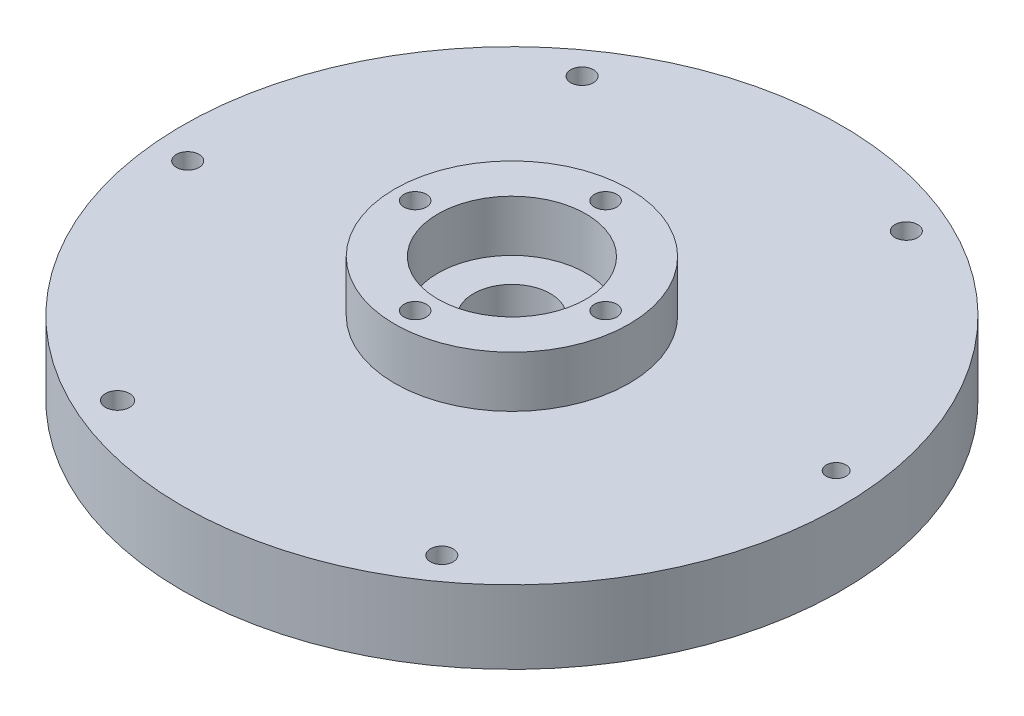
ISO-10303-21;
HEADER;
FILE_DESCRIPTION(('STEP AP214'),'2;1');
FILE_NAME('part.step','',(''),(''),'','','');
FILE_SCHEMA(('AUTOMOTIVE_DESIGN { 1 0 10303 214 1 1 1 1 }'));
ENDSEC;
DATA;
#1=APPLICATION_CONTEXT('core data for automotive mechanical design processes');
#2=APPLICATION_PROTOCOL_DEFINITION('international standard','automotive_design',2000,#1);
#3=PRODUCT_CONTEXT('',#1,'mechanical');
#4=PRODUCT('Part','Part','',(#3));
#5=PRODUCT_RELATED_PRODUCT_CATEGORY('part','',(#4));
#6=PRODUCT_DEFINITION_FORMATION('','',#4);
#7=PRODUCT_DEFINITION_CONTEXT('part definition',#1,'design');
#8=PRODUCT_DEFINITION('design','',#6,#7);
#9=PRODUCT_DEFINITION_SHAPE('','',#8);
#10=(LENGTH_UNIT() NAMED_UNIT(*) SI_UNIT(.MILLI.,.METRE.));
#11=(NAMED_UNIT(*) PLANE_ANGLE_UNIT() SI_UNIT($,.RADIAN.));
#12=(NAMED_UNIT(*) SI_UNIT($,.STERADIAN.) SOLID_ANGLE_UNIT());
#13=UNCERTAINTY_MEASURE_WITH_UNIT(LENGTH_MEASURE(1.E-05),#10,'distance_accuracy_value','');
#14=(GEOMETRIC_REPRESENTATION_CONTEXT(3) GLOBAL_UNCERTAINTY_ASSIGNED_CONTEXT((#13)) GLOBAL_UNIT_ASSIGNED_CONTEXT((#10,
#11,#12)) REPRESENTATION_CONTEXT('',''));
#15=CARTESIAN_POINT('',(0.,0.,0.));
#16=DIRECTION('',(0.,0.,1.));
#17=DIRECTION('',(1.,0.,0.));
#18=AXIS2_PLACEMENT_3D('',#15,#16,#17);
#19=CARTESIAN_POINT('',(-0.21335123837228,-29.,-13.));
#20=DIRECTION('',(0.,1.,0.));
#21=DIRECTION('',(0.,0.,1.));
#22=AXIS2_PLACEMENT_3D('',#19,#20,#21);
#23=CYLINDRICAL_SURFACE('',#22,1.525);
#24=CARTESIAN_POINT('',(-0.21335123837228,17.,-13.));
#25=DIRECTION('',(0.,1.,0.));
#26=DIRECTION('',(0.,0.,1.));
#27=AXIS2_PLACEMENT_3D('',#24,#25,#26);
#28=CIRCLE('',#27,1.525);
#29=CARTESIAN_POINT('',(-0.21335123837228,17.,-11.475));
#30=VERTEX_POINT('',#29);
#31=EDGE_CURVE('E65',#30,#30,#28,.T.);
#32=ORIENTED_EDGE('',*,*,#31,.T.);
#33=EDGE_LOOP('',(#32));
#34=FACE_BOUND('',#33,.T.);
#35=CARTESIAN_POINT('',(-0.21335123837228,7.,-13.));
#36=DIRECTION('',(0.,-1.,0.));
#37=DIRECTION('',(0.,0.,-1.));
#38=AXIS2_PLACEMENT_3D('',#35,#36,#37);
#39=CIRCLE('',#38,1.525);
#40=CARTESIAN_POINT('',(-0.21335123837228,7.,-14.525));
#41=VERTEX_POINT('',#40);
#42=EDGE_CURVE('E41',#41,#41,#39,.F.);
#43=ORIENTED_EDGE('',*,*,#42,.F.);
#44=EDGE_LOOP('',(#43));
#45=FACE_BOUND('',#44,.T.);
#46=ADVANCED_FACE('F37',(#34,#45),#23,.F.);
#47=CARTESIAN_POINT('',(-13.2133512383723,-29.,0.));
#48=DIRECTION('',(0.,1.,0.));
#49=DIRECTION('',(0.,0.,1.));
#50=AXIS2_PLACEMENT_3D('',#47,#48,#49);
#51=CYLINDRICAL_SURFACE('',#50,1.525);
#52=CARTESIAN_POINT('',(-13.2133512383723,17.,0.));
#53=DIRECTION('',(0.,1.,0.));
#54=DIRECTION('',(0.,0.,1.));
#55=AXIS2_PLACEMENT_3D('',#52,#53,#54);
#56=CIRCLE('',#55,1.525);
#57=CARTESIAN_POINT('',(-13.2133512383723,17.,1.525));
#58=VERTEX_POINT('',#57);
#59=EDGE_CURVE('E69',#58,#58,#56,.T.);
#60=ORIENTED_EDGE('',*,*,#59,.T.);
#61=EDGE_LOOP('',(#60));
#62=FACE_BOUND('',#61,.T.);
#63=CARTESIAN_POINT('',(-13.2133512383723,7.,0.));
#64=DIRECTION('',(0.,-1.,0.));
#65=DIRECTION('',(0.,0.,-1.));
#66=AXIS2_PLACEMENT_3D('',#63,#64,#65);
#67=CIRCLE('',#66,1.525);
#68=CARTESIAN_POINT('',(-13.2133512383723,7.,-1.525));
#69=VERTEX_POINT('',#68);
#70=EDGE_CURVE('E60',#69,#69,#67,.F.);
#71=ORIENTED_EDGE('',*,*,#70,.F.);
#72=EDGE_LOOP('',(#71));
#73=FACE_BOUND('',#72,.T.);
#74=ADVANCED_FACE('F169',(#62,#73),#51,.F.);
#75=CARTESIAN_POINT('',(-0.213351238372283,-29.,13.));
#76=DIRECTION('',(0.,1.,0.));
#77=DIRECTION('',(0.,0.,1.));
#78=AXIS2_PLACEMENT_3D('',#75,#76,#77);
#79=CYLINDRICAL_SURFACE('',#78,1.525);
#80=CARTESIAN_POINT('',(-0.213351238372283,17.,13.));
#81=DIRECTION('',(0.,1.,0.));
#82=DIRECTION('',(0.,0.,1.));
#83=AXIS2_PLACEMENT_3D('',#80,#81,#82);
#84=CIRCLE('',#83,1.525);
#85=CARTESIAN_POINT('',(-0.213351238372283,17.,14.525));
#86=VERTEX_POINT('',#85);
#87=EDGE_CURVE('E74',#86,#86,#84,.T.);
#88=ORIENTED_EDGE('',*,*,#87,.T.);
#89=EDGE_LOOP('',(#88));
#90=FACE_BOUND('',#89,.T.);
#91=CARTESIAN_POINT('',(-0.213351238372283,7.,13.));
#92=DIRECTION('',(0.,-1.,0.));
#93=DIRECTION('',(0.,0.,-1.));
#94=AXIS2_PLACEMENT_3D('',#91,#92,#93);
#95=CIRCLE('',#94,1.525);
#96=CARTESIAN_POINT('',(-0.213351238372283,7.,11.475));
#97=VERTEX_POINT('',#96);
#98=EDGE_CURVE('E57',#97,#97,#95,.F.);
#99=ORIENTED_EDGE('',*,*,#98,.F.);
#100=EDGE_LOOP('',(#99));
#101=FACE_BOUND('',#100,.T.);
#102=ADVANCED_FACE('F175',(#90,#101),#79,.F.);
#103=CARTESIAN_POINT('',(12.7866487616277,-29.,0.));
#104=DIRECTION('',(0.,1.,0.));
#105=DIRECTION('',(0.,0.,1.));
#106=AXIS2_PLACEMENT_3D('',#103,#104,#105);
#107=CYLINDRICAL_SURFACE('',#106,1.525);
#108=CARTESIAN_POINT('',(12.7866487616277,17.,0.));
#109=DIRECTION('',(0.,1.,0.));
#110=DIRECTION('',(0.,0.,1.));
#111=AXIS2_PLACEMENT_3D('',#108,#109,#110);
#112=CIRCLE('',#111,1.525);
#113=CARTESIAN_POINT('',(12.7866487616277,17.,1.525));
#114=VERTEX_POINT('',#113);
#115=EDGE_CURVE('E82',#114,#114,#112,.T.);
#116=ORIENTED_EDGE('',*,*,#115,.T.);
#117=EDGE_LOOP('',(#116));
#118=FACE_BOUND('',#117,.T.);
#119=CARTESIAN_POINT('',(12.7866487616277,7.,0.));
#120=DIRECTION('',(0.,-1.,0.));
#121=DIRECTION('',(0.,0.,-1.));
#122=AXIS2_PLACEMENT_3D('',#119,#120,#121);
#123=CIRCLE('',#122,1.525);
#124=CARTESIAN_POINT('',(12.7866487616277,7.,-1.525));
#125=VERTEX_POINT('',#124);
#126=EDGE_CURVE('E54',#125,#125,#123,.F.);
#127=ORIENTED_EDGE('',*,*,#126,.F.);
#128=EDGE_LOOP('',(#127));
#129=FACE_BOUND('',#128,.T.);
#130=ADVANCED_FACE('F270',(#118,#129),#107,.F.);
#131=CARTESIAN_POINT('',(0.,10.,0.));
#132=DIRECTION('',(0.,1.,0.));
#133=DIRECTION('',(0.,0.,1.));
#134=AXIS2_PLACEMENT_3D('',#131,#132,#133);
#135=PLANE('',#134);
#136=CARTESIAN_POINT('',(0.,10.,0.));
#137=DIRECTION('',(0.,1.,0.));
#138=DIRECTION('',(0.,0.,1.));
#139=AXIS2_PLACEMENT_3D('',#136,#137,#138);
#140=CIRCLE('',#139,5.25);
#141=CARTESIAN_POINT('',(0.,10.,5.25));
#142=VERTEX_POINT('',#141);
#143=EDGE_CURVE('E113',#142,#142,#140,.T.);
#144=ORIENTED_EDGE('',*,*,#143,.F.);
#145=EDGE_LOOP('',(#144));
#146=FACE_BOUND('',#145,.T.);
#147=CARTESIAN_POINT('',(0.,10.,0.));
#148=DIRECTION('',(0.,1.,0.));
#149=DIRECTION('',(0.,0.,1.));
#150=AXIS2_PLACEMENT_3D('',#147,#148,#149);
#151=CIRCLE('',#150,10.1);
#152=CARTESIAN_POINT('',(0.,10.,10.1));
#153=VERTEX_POINT('',#152);
#154=EDGE_CURVE('E10',#153,#153,#151,.F.);
#155=ORIENTED_EDGE('',*,*,#154,.F.);
#156=EDGE_LOOP('',(#155));
#157=FACE_BOUND('',#156,.T.);
#158=ADVANCED_FACE('F211',(#146,#157),#135,.T.);
#159=CARTESIAN_POINT('',(0.,5.,0.));
#160=DIRECTION('',(0.,1.,0.));
#161=DIRECTION('',(0.,0.,1.));
#162=AXIS2_PLACEMENT_3D('',#159,#160,#161);
#163=PLANE('',#162);
#164=CARTESIAN_POINT('',(-16.9101451998769,5.,36.9388445889834));
#165=DIRECTION('',(0.,1.,0.));
#166=DIRECTION('',(0.,0.,1.));
#167=AXIS2_PLACEMENT_3D('',#164,#165,#166);
#168=CIRCLE('',#167,1.55);
#169=CARTESIAN_POINT('',(-16.9101451998769,5.,38.4888445889834));
#170=VERTEX_POINT('',#169);
#171=EDGE_CURVE('E138',#170,#170,#168,.T.);
#172=ORIENTED_EDGE('',*,*,#171,.F.);
#173=EDGE_LOOP('',(#172));
#174=FACE_BOUND('',#173,.T.);
#175=CARTESIAN_POINT('',(-16.9101451998769,5.,36.9388445889834));
#176=DIRECTION('',(0.,1.,0.));
#177=DIRECTION('',(0.,0.,1.));
#178=AXIS2_PLACEMENT_3D('',#175,#176,#177);
#179=CIRCLE('',#178,1.64952832415317);
#180=CARTESIAN_POINT('',(-16.9101451998769,5.,38.5883729131366));
#181=VERTEX_POINT('',#180);
#182=EDGE_CURVE('E94',#181,#181,#179,.T.);
#183=ORIENTED_EDGE('',*,*,#182,.T.);
#184=EDGE_LOOP('',(#183));
#185=FACE_BOUND('',#184,.T.);
#186=ADVANCED_FACE('F240',(#174,#185),#163,.T.);
#187=CARTESIAN_POINT('',(0.,0.,0.));
#188=DIRECTION('',(0.,1.,0.));
#189=DIRECTION('',(0.,0.,1.));
#190=AXIS2_PLACEMENT_3D('',#187,#188,#189);
#191=PLANE('',#190);
#192=CARTESIAN_POINT('',(-0.21335123837228,0.,-13.));
#193=DIRECTION('',(0.,-1.,0.));
#194=DIRECTION('',(0.,0.,-1.));
#195=AXIS2_PLACEMENT_3D('',#192,#193,#194);
#196=CIRCLE('',#195,3.27573744559482);
#197=CARTESIAN_POINT('',(-0.21335123837228,0.,-16.2757374455948));
#198=VERTEX_POINT('',#197);
#199=EDGE_CURVE('E441',#198,#198,#196,.T.);
#200=ORIENTED_EDGE('',*,*,#199,.F.);
#201=EDGE_LOOP('',(#200));
#202=FACE_BOUND('',#201,.T.);
#203=CARTESIAN_POINT('',(-13.,0.,0.213351238372324));
#204=DIRECTION('',(0.,-1.,0.));
#205=DIRECTION('',(0.,0.,-1.));
#206=AXIS2_PLACEMENT_3D('',#203,#204,#205);
#207=CIRCLE('',#206,3.27573744559482);
#208=CARTESIAN_POINT('',(-13.,0.,-3.0623862072225));
#209=VERTEX_POINT('',#208);
#210=EDGE_CURVE('E442',#209,#209,#207,.T.);
#211=ORIENTED_EDGE('',*,*,#210,.F.);
#212=EDGE_LOOP('',(#211));
#213=FACE_BOUND('',#212,.T.);
#214=CARTESIAN_POINT('',(0.213351238372371,0.,13.));
#215=DIRECTION('',(0.,-1.,0.));
#216=DIRECTION('',(0.,0.,-1.));
#217=AXIS2_PLACEMENT_3D('',#214,#215,#216);
#218=CIRCLE('',#217,3.27573744559482);
#219=CARTESIAN_POINT('',(0.213351238372371,0.,9.72426255440518));
#220=VERTEX_POINT('',#219);
#221=EDGE_CURVE('E451',#220,#220,#218,.T.);
#222=ORIENTED_EDGE('',*,*,#221,.F.);
#223=EDGE_LOOP('',(#222));
#224=FACE_BOUND('',#223,.T.);
#225=CARTESIAN_POINT('',(13.,0.,-0.213351238372416));
#226=DIRECTION('',(0.,-1.,0.));
#227=DIRECTION('',(0.,0.,-1.));
#228=AXIS2_PLACEMENT_3D('',#225,#226,#227);
#229=CIRCLE('',#228,3.27573744559482);
#230=CARTESIAN_POINT('',(13.,0.,-3.48908868396724));
#231=VERTEX_POINT('',#230);
#232=EDGE_CURVE('E457',#231,#231,#229,.T.);
#233=ORIENTED_EDGE('',*,*,#232,.F.);
#234=EDGE_LOOP('',(#233));
#235=FACE_BOUND('',#234,.T.);
#236=CARTESIAN_POINT('',(0.,0.,0.));
#237=DIRECTION('',(0.,1.,0.));
#238=DIRECTION('',(0.,0.,1.));
#239=AXIS2_PLACEMENT_3D('',#236,#237,#238);
#240=CIRCLE('',#239,45.);
#241=CARTESIAN_POINT('',(0.,0.,45.));
#242=VERTEX_POINT('',#241);
#243=EDGE_CURVE('E45',#242,#242,#240,.T.);
#244=ORIENTED_EDGE('',*,*,#243,.F.);
#245=EDGE_LOOP('',(#244));
#246=FACE_BOUND('',#245,.T.);
#247=CARTESIAN_POINT('',(0.,0.,0.));
#248=DIRECTION('',(0.,1.,0.));
#249=DIRECTION('',(0.,0.,1.));
#250=AXIS2_PLACEMENT_3D('',#247,#248,#249);
#251=CIRCLE('',#250,9.55);
#252=CARTESIAN_POINT('',(0.,0.,9.55));
#253=VERTEX_POINT('',#252);
#254=EDGE_CURVE('E50',#253,#253,#251,.T.);
#255=ORIENTED_EDGE('',*,*,#254,.T.);
#256=EDGE_LOOP('',(#255));
#257=FACE_BOUND('',#256,.T.);
#258=CARTESIAN_POINT('',(23.534905200567,0.,33.1140376192684));
#259=DIRECTION('',(0.,1.,0.));
#260=DIRECTION('',(0.,0.,1.));
#261=AXIS2_PLACEMENT_3D('',#258,#259,#260);
#262=CIRCLE('',#261,1.55);
#263=CARTESIAN_POINT('',(23.534905200567,0.,34.6640376192684));
#264=VERTEX_POINT('',#263);
#265=EDGE_CURVE('E141',#264,#264,#262,.T.);
#266=ORIENTED_EDGE('',*,*,#265,.T.);
#267=EDGE_LOOP('',(#266));
#268=FACE_BOUND('',#267,.T.);
#269=CARTESIAN_POINT('',(-16.9101451998769,0.,36.9388445889834));
#270=DIRECTION('',(0.,1.,0.));
#271=DIRECTION('',(0.,0.,1.));
#272=AXIS2_PLACEMENT_3D('',#269,#270,#271);
#273=CIRCLE('',#272,1.55);
#274=CARTESIAN_POINT('',(-16.9101451998769,0.,38.4888445889834));
#275=VERTEX_POINT('',#274);
#276=EDGE_CURVE('E137',#275,#275,#273,.T.);
#277=ORIENTED_EDGE('',*,*,#276,.T.);
#278=EDGE_LOOP('',(#277));
#279=FACE_BOUND('',#278,.T.);
#280=CARTESIAN_POINT('',(-40.4450504004438,0.,3.82480696971451));
#281=DIRECTION('',(0.,1.,0.));
#282=DIRECTION('',(0.,0.,1.));
#283=AXIS2_PLACEMENT_3D('',#280,#281,#282);
#284=CIRCLE('',#283,1.54999999999999);
#285=CARTESIAN_POINT('',(-40.4450504004438,0.,5.3748069697145));
#286=VERTEX_POINT('',#285);
#287=EDGE_CURVE('E134',#286,#286,#284,.T.);
#288=ORIENTED_EDGE('',*,*,#287,.T.);
#289=EDGE_LOOP('',(#288));
#290=FACE_BOUND('',#289,.T.);
#291=CARTESIAN_POINT('',(-23.5349052005668,0.,-33.1140376192694));
#292=DIRECTION('',(0.,1.,0.));
#293=DIRECTION('',(0.,0.,1.));
#294=AXIS2_PLACEMENT_3D('',#291,#292,#293);
#295=CIRCLE('',#294,1.55000000000001);
#296=CARTESIAN_POINT('',(-23.5349052005668,0.,-31.5640376192694));
#297=VERTEX_POINT('',#296);
#298=EDGE_CURVE('E131',#297,#297,#295,.T.);
#299=ORIENTED_EDGE('',*,*,#298,.T.);
#300=EDGE_LOOP('',(#299));
#301=FACE_BOUND('',#300,.T.);
#302=CARTESIAN_POINT('',(16.9101451998771,0.,-36.9388445889843));
#303=DIRECTION('',(0.,1.,0.));
#304=DIRECTION('',(0.,0.,1.));
#305=AXIS2_PLACEMENT_3D('',#302,#303,#304);
#306=CIRCLE('',#305,1.55000000000001);
#307=CARTESIAN_POINT('',(16.9101451998771,0.,-35.3888445889843));
#308=VERTEX_POINT('',#307);
#309=EDGE_CURVE('E128',#308,#308,#306,.T.);
#310=ORIENTED_EDGE('',*,*,#309,.T.);
#311=EDGE_LOOP('',(#310));
#312=FACE_BOUND('',#311,.T.);
#313=CARTESIAN_POINT('',(40.4450504004435,0.,-3.82480696971536));
#314=DIRECTION('',(0.,1.,0.));
#315=DIRECTION('',(0.,0.,1.));
#316=AXIS2_PLACEMENT_3D('',#313,#314,#315);
#317=CIRCLE('',#316,1.55);
#318=CARTESIAN_POINT('',(40.4450504004435,0.,-2.27480696971536));
#319=VERTEX_POINT('',#318);
#320=EDGE_CURVE('E125',#319,#319,#317,.T.);
#321=ORIENTED_EDGE('',*,*,#320,.T.);
#322=EDGE_LOOP('',(#321));
#323=FACE_BOUND('',#322,.T.);
#324=ADVANCED_FACE('F150',(#202,#213,#224,#235,#246,#257,#268,#279,#290,#301,#312,#323),#191,.F.);
#325=CARTESIAN_POINT('',(0.,5.,0.));
#326=DIRECTION('',(0.,-1.,0.));
#327=DIRECTION('',(0.,0.,-1.));
#328=AXIS2_PLACEMENT_3D('',#325,#326,#327);
#329=CYLINDRICAL_SURFACE('',#328,45.);
#330=ORIENTED_EDGE('',*,*,#243,.T.);
#331=EDGE_LOOP('',(#330));
#332=FACE_BOUND('',#331,.T.);
#333=CARTESIAN_POINT('',(0.,10.,0.));
#334=DIRECTION('',(0.,1.,0.));
#335=DIRECTION('',(0.,0.,1.));
#336=AXIS2_PLACEMENT_3D('',#333,#334,#335);
#337=CIRCLE('',#336,45.);
#338=CARTESIAN_POINT('',(0.,10.,45.));
#339=VERTEX_POINT('',#338);
#340=EDGE_CURVE('E116',#339,#339,#337,.T.);
#341=ORIENTED_EDGE('',*,*,#340,.F.);
#342=EDGE_LOOP('',(#341));
#343=FACE_BOUND('',#342,.T.);
#344=ADVANCED_FACE('F39',(#332,#343),#329,.T.);
#345=CARTESIAN_POINT('',(0.,5.,0.));
#346=DIRECTION('',(0.,-1.,0.));
#347=DIRECTION('',(0.,0.,-1.));
#348=AXIS2_PLACEMENT_3D('',#345,#346,#347);
#349=CYLINDRICAL_SURFACE('',#348,9.55);
#350=CARTESIAN_POINT('',(0.,5.,0.));
#351=DIRECTION('',(0.,1.,0.));
#352=DIRECTION('',(0.,0.,1.));
#353=AXIS2_PLACEMENT_3D('',#350,#351,#352);
#354=CIRCLE('',#353,9.55);
#355=CARTESIAN_POINT('',(0.,5.,9.55));
#356=VERTEX_POINT('',#355);
#357=EDGE_CURVE('E124',#356,#356,#354,.T.);
#358=ORIENTED_EDGE('',*,*,#357,.T.);
#359=EDGE_LOOP('',(#358));
#360=FACE_BOUND('',#359,.T.);
#361=ORIENTED_EDGE('',*,*,#254,.F.);
#362=EDGE_LOOP('',(#361));
#363=FACE_BOUND('',#362,.T.);
#364=ADVANCED_FACE('F153',(#360,#363),#349,.F.);
#365=CARTESIAN_POINT('',(23.534905200567,5.,33.1140376192684));
#366=DIRECTION('',(0.,-1.,0.));
#367=DIRECTION('',(0.,0.,-1.));
#368=AXIS2_PLACEMENT_3D('',#365,#366,#367);
#369=CYLINDRICAL_SURFACE('',#368,1.55);
#370=ORIENTED_EDGE('',*,*,#265,.F.);
#371=EDGE_LOOP('',(#370));
#372=FACE_BOUND('',#371,.T.);
#373=CARTESIAN_POINT('',(23.534905200567,10.,33.1140376192684));
#374=DIRECTION('',(0.,1.,0.));
#375=DIRECTION('',(0.,0.,1.));
#376=AXIS2_PLACEMENT_3D('',#373,#374,#375);
#377=CIRCLE('',#376,1.55);
#378=CARTESIAN_POINT('',(23.534905200567,10.,34.6640376192684));
#379=VERTEX_POINT('',#378);
#380=EDGE_CURVE('E98',#379,#379,#377,.T.);
#381=ORIENTED_EDGE('',*,*,#380,.T.);
#382=EDGE_LOOP('',(#381));
#383=FACE_BOUND('',#382,.T.);
#384=ADVANCED_FACE('F155',(#372,#383),#369,.F.);
#385=CARTESIAN_POINT('',(-16.9101451998769,5.,36.9388445889834));
#386=DIRECTION('',(0.,-1.,0.));
#387=DIRECTION('',(0.,0.,-1.));
#388=AXIS2_PLACEMENT_3D('',#385,#386,#387);
#389=CYLINDRICAL_SURFACE('',#388,1.55);
#390=ORIENTED_EDGE('',*,*,#171,.T.);
#391=EDGE_LOOP('',(#390));
#392=FACE_BOUND('',#391,.T.);
#393=ORIENTED_EDGE('',*,*,#276,.F.);
#394=EDGE_LOOP('',(#393));
#395=FACE_BOUND('',#394,.T.);
#396=ADVANCED_FACE('F162',(#392,#395),#389,.F.);
#397=CARTESIAN_POINT('',(-40.4450504004438,5.,3.82480696971451));
#398=DIRECTION('',(0.,-1.,0.));
#399=DIRECTION('',(0.,0.,-1.));
#400=AXIS2_PLACEMENT_3D('',#397,#398,#399);
#401=CYLINDRICAL_SURFACE('',#400,1.54999999999999);
#402=ORIENTED_EDGE('',*,*,#287,.F.);
#403=EDGE_LOOP('',(#402));
#404=FACE_BOUND('',#403,.T.);
#405=CARTESIAN_POINT('',(-40.4450504004438,10.,3.82480696971451));
#406=DIRECTION('',(0.,1.,0.));
#407=DIRECTION('',(0.,0.,1.));
#408=AXIS2_PLACEMENT_3D('',#405,#406,#407);
#409=CIRCLE('',#408,1.54999999999999);
#410=CARTESIAN_POINT('',(-40.4450504004438,10.,5.3748069697145));
#411=VERTEX_POINT('',#410);
#412=EDGE_CURVE('E91',#411,#411,#409,.T.);
#413=ORIENTED_EDGE('',*,*,#412,.T.);
#414=EDGE_LOOP('',(#413));
#415=FACE_BOUND('',#414,.T.);
#416=ADVANCED_FACE('F226',(#404,#415),#401,.F.);
#417=CARTESIAN_POINT('',(-23.5349052005668,5.,-33.1140376192694));
#418=DIRECTION('',(0.,-1.,0.));
#419=DIRECTION('',(0.,0.,-1.));
#420=AXIS2_PLACEMENT_3D('',#417,#418,#419);
#421=CYLINDRICAL_SURFACE('',#420,1.55000000000001);
#422=ORIENTED_EDGE('',*,*,#298,.F.);
#423=EDGE_LOOP('',(#422));
#424=FACE_BOUND('',#423,.T.);
#425=CARTESIAN_POINT('',(-23.5349052005668,10.,-33.1140376192694));
#426=DIRECTION('',(0.,1.,0.));
#427=DIRECTION('',(0.,0.,1.));
#428=AXIS2_PLACEMENT_3D('',#425,#426,#427);
#429=CIRCLE('',#428,1.55);
#430=CARTESIAN_POINT('',(-23.5349052005668,10.,-31.5640376192694));
#431=VERTEX_POINT('',#430);
#432=EDGE_CURVE('E86',#431,#431,#429,.T.);
#433=ORIENTED_EDGE('',*,*,#432,.T.);
#434=EDGE_LOOP('',(#433));
#435=FACE_BOUND('',#434,.T.);
#436=ADVANCED_FACE('F222',(#424,#435),#421,.F.);
#437=CARTESIAN_POINT('',(16.9101451998771,5.,-36.9388445889843));
#438=DIRECTION('',(0.,-1.,0.));
#439=DIRECTION('',(0.,0.,-1.));
#440=AXIS2_PLACEMENT_3D('',#437,#438,#439);
#441=CYLINDRICAL_SURFACE('',#440,1.55000000000001);
#442=ORIENTED_EDGE('',*,*,#309,.F.);
#443=EDGE_LOOP('',(#442));
#444=FACE_BOUND('',#443,.T.);
#445=CARTESIAN_POINT('',(16.9101451998771,10.,-36.9388445889843));
#446=DIRECTION('',(0.,1.,0.));
#447=DIRECTION('',(0.,0.,1.));
#448=AXIS2_PLACEMENT_3D('',#445,#446,#447);
#449=CIRCLE('',#448,1.55);
#450=CARTESIAN_POINT('',(16.9101451998771,10.,-35.3888445889843));
#451=VERTEX_POINT('',#450);
#452=EDGE_CURVE('E107',#451,#451,#449,.T.);
#453=ORIENTED_EDGE('',*,*,#452,.T.);
#454=EDGE_LOOP('',(#453));
#455=FACE_BOUND('',#454,.T.);
#456=ADVANCED_FACE('F218',(#444,#455),#441,.F.);
#457=CARTESIAN_POINT('',(40.4450504004435,5.,-3.82480696971536));
#458=DIRECTION('',(0.,-1.,0.));
#459=DIRECTION('',(0.,0.,-1.));
#460=AXIS2_PLACEMENT_3D('',#457,#458,#459);
#461=CYLINDRICAL_SURFACE('',#460,1.55);
#462=CARTESIAN_POINT('',(40.4450504004435,5.,-3.82480696971536));
#463=DIRECTION('',(0.,1.,0.));
#464=DIRECTION('',(0.,0.,1.));
#465=AXIS2_PLACEMENT_3D('',#462,#463,#464);
#466=CIRCLE('',#465,1.55);
#467=CARTESIAN_POINT('',(40.4450504004435,5.,-2.27480696971536));
#468=VERTEX_POINT('',#467);
#469=EDGE_CURVE('E121',#468,#468,#466,.T.);
#470=ORIENTED_EDGE('',*,*,#469,.T.);
#471=EDGE_LOOP('',(#470));
#472=FACE_BOUND('',#471,.T.);
#473=ORIENTED_EDGE('',*,*,#320,.F.);
#474=EDGE_LOOP('',(#473));
#475=FACE_BOUND('',#474,.T.);
#476=ADVANCED_FACE('F215',(#472,#475),#461,.F.);
#477=CARTESIAN_POINT('',(0.,5.,0.));
#478=DIRECTION('',(0.,1.,0.));
#479=DIRECTION('',(0.,0.,1.));
#480=AXIS2_PLACEMENT_3D('',#477,#478,#479);
#481=PLANE('',#480);
#482=ORIENTED_EDGE('',*,*,#357,.F.);
#483=EDGE_LOOP('',(#482));
#484=FACE_BOUND('',#483,.T.);
#485=CARTESIAN_POINT('',(0.,5.,0.));
#486=DIRECTION('',(0.,1.,0.));
#487=DIRECTION('',(0.,0.,1.));
#488=AXIS2_PLACEMENT_3D('',#485,#486,#487);
#489=CIRCLE('',#488,5.25);
#490=CARTESIAN_POINT('',(0.,5.,5.25));
#491=VERTEX_POINT('',#490);
#492=EDGE_CURVE('E112',#491,#491,#489,.T.);
#493=ORIENTED_EDGE('',*,*,#492,.T.);
#494=EDGE_LOOP('',(#493));
#495=FACE_BOUND('',#494,.T.);
#496=ADVANCED_FACE('F209',(#484,#495),#481,.F.);
#497=CARTESIAN_POINT('',(0.,10.,0.));
#498=DIRECTION('',(0.,1.,0.));
#499=DIRECTION('',(0.,0.,1.));
#500=AXIS2_PLACEMENT_3D('',#497,#498,#499);
#501=CIRCLE('',#500,16.);
#502=CARTESIAN_POINT('',(0.,10.,16.));
#503=VERTEX_POINT('',#502);
#504=EDGE_CURVE('E81',#503,#503,#501,.T.);
#505=ORIENTED_EDGE('',*,*,#504,.F.);
#506=EDGE_LOOP('',(#505));
#507=FACE_BOUND('',#506,.T.);
#508=ORIENTED_EDGE('',*,*,#412,.F.);
#509=EDGE_LOOP('',(#508));
#510=FACE_BOUND('',#509,.T.);
#511=ORIENTED_EDGE('',*,*,#380,.F.);
#512=EDGE_LOOP('',(#511));
#513=FACE_BOUND('',#512,.T.);
#514=ORIENTED_EDGE('',*,*,#452,.F.);
#515=EDGE_LOOP('',(#514));
#516=FACE_BOUND('',#515,.T.);
#517=ORIENTED_EDGE('',*,*,#340,.T.);
#518=EDGE_LOOP('',(#517));
#519=FACE_BOUND('',#518,.T.);
#520=CARTESIAN_POINT('',(40.4450504004435,10.,-3.82480696971536));
#521=DIRECTION('',(0.,1.,0.));
#522=DIRECTION('',(0.,0.,1.));
#523=AXIS2_PLACEMENT_3D('',#520,#521,#522);
#524=CIRCLE('',#523,1.3476646286438);
#525=CARTESIAN_POINT('',(40.4450504004435,10.,-2.47714234107156));
#526=VERTEX_POINT('',#525);
#527=EDGE_CURVE('E104',#526,#526,#524,.T.);
#528=ORIENTED_EDGE('',*,*,#527,.F.);
#529=EDGE_LOOP('',(#528));
#530=FACE_BOUND('',#529,.T.);
#531=CARTESIAN_POINT('',(-16.9101451998769,10.,36.9388445889834));
#532=DIRECTION('',(0.,1.,0.));
#533=DIRECTION('',(0.,0.,1.));
#534=AXIS2_PLACEMENT_3D('',#531,#532,#533);
#535=CIRCLE('',#534,1.64952832415317);
#536=CARTESIAN_POINT('',(-16.9101451998769,10.,38.5883729131366));
#537=VERTEX_POINT('',#536);
#538=EDGE_CURVE('E95',#537,#537,#535,.T.);
#539=ORIENTED_EDGE('',*,*,#538,.F.);
#540=EDGE_LOOP('',(#539));
#541=FACE_BOUND('',#540,.T.);
#542=ORIENTED_EDGE('',*,*,#432,.F.);
#543=EDGE_LOOP('',(#542));
#544=FACE_BOUND('',#543,.T.);
#545=ADVANCED_FACE('F206',(#507,#510,#513,#516,#519,#530,#541,#544),#135,.T.);
#546=ORIENTED_EDGE('',*,*,#469,.F.);
#547=EDGE_LOOP('',(#546));
#548=FACE_BOUND('',#547,.T.);
#549=CARTESIAN_POINT('',(40.4450504004435,5.,-3.82480696971536));
#550=DIRECTION('',(0.,1.,0.));
#551=DIRECTION('',(0.,0.,1.));
#552=AXIS2_PLACEMENT_3D('',#549,#550,#551);
#553=CIRCLE('',#552,1.3476646286438);
#554=CARTESIAN_POINT('',(40.4450504004435,5.,-2.47714234107156));
#555=VERTEX_POINT('',#554);
#556=EDGE_CURVE('E103',#555,#555,#553,.T.);
#557=ORIENTED_EDGE('',*,*,#556,.T.);
#558=EDGE_LOOP('',(#557));
#559=FACE_BOUND('',#558,.T.);
#560=ADVANCED_FACE('F204',(#548,#559),#481,.F.);
#561=CARTESIAN_POINT('',(0.,10.,0.));
#562=DIRECTION('',(0.,-1.,0.));
#563=DIRECTION('',(0.,0.,-1.));
#564=AXIS2_PLACEMENT_3D('',#561,#562,#563);
#565=CYLINDRICAL_SURFACE('',#564,5.25);
#566=ORIENTED_EDGE('',*,*,#143,.T.);
#567=EDGE_LOOP('',(#566));
#568=FACE_BOUND('',#567,.T.);
#569=ORIENTED_EDGE('',*,*,#492,.F.);
#570=EDGE_LOOP('',(#569));
#571=FACE_BOUND('',#570,.T.);
#572=ADVANCED_FACE('F200',(#568,#571),#565,.F.);
#573=CARTESIAN_POINT('',(40.4450504004435,10.,-3.82480696971536));
#574=DIRECTION('',(0.,-1.,0.));
#575=DIRECTION('',(0.,0.,-1.));
#576=AXIS2_PLACEMENT_3D('',#573,#574,#575);
#577=CYLINDRICAL_SURFACE('',#576,1.3476646286438);
#578=ORIENTED_EDGE('',*,*,#527,.T.);
#579=EDGE_LOOP('',(#578));
#580=FACE_BOUND('',#579,.T.);
#581=ORIENTED_EDGE('',*,*,#556,.F.);
#582=EDGE_LOOP('',(#581));
#583=FACE_BOUND('',#582,.T.);
#584=ADVANCED_FACE('F196',(#580,#583),#577,.F.);
#585=CARTESIAN_POINT('',(-16.9101451998769,10.,36.9388445889834));
#586=DIRECTION('',(0.,-1.,0.));
#587=DIRECTION('',(0.,0.,-1.));
#588=AXIS2_PLACEMENT_3D('',#585,#586,#587);
#589=CYLINDRICAL_SURFACE('',#588,1.64952832415317);
#590=ORIENTED_EDGE('',*,*,#538,.T.);
#591=EDGE_LOOP('',(#590));
#592=FACE_BOUND('',#591,.T.);
#593=ORIENTED_EDGE('',*,*,#182,.F.);
#594=EDGE_LOOP('',(#593));
#595=FACE_BOUND('',#594,.T.);
#596=ADVANCED_FACE('F189',(#592,#595),#589,.F.);
#597=CARTESIAN_POINT('',(0.,17.,0.));
#598=DIRECTION('',(0.,1.,0.));
#599=DIRECTION('',(0.,0.,1.));
#600=AXIS2_PLACEMENT_3D('',#597,#598,#599);
#601=PLANE('',#600);
#602=ORIENTED_EDGE('',*,*,#115,.F.);
#603=EDGE_LOOP('',(#602));
#604=FACE_BOUND('',#603,.T.);
#605=ORIENTED_EDGE('',*,*,#87,.F.);
#606=EDGE_LOOP('',(#605));
#607=FACE_BOUND('',#606,.T.);
#608=ORIENTED_EDGE('',*,*,#59,.F.);
#609=EDGE_LOOP('',(#608));
#610=FACE_BOUND('',#609,.T.);
#611=ORIENTED_EDGE('',*,*,#31,.F.);
#612=EDGE_LOOP('',(#611));
#613=FACE_BOUND('',#612,.T.);
#614=CARTESIAN_POINT('',(0.,17.,0.));
#615=DIRECTION('',(0.,1.,0.));
#616=DIRECTION('',(0.,0.,1.));
#617=AXIS2_PLACEMENT_3D('',#614,#615,#616);
#618=CIRCLE('',#617,16.);
#619=CARTESIAN_POINT('',(0.,17.,16.));
#620=VERTEX_POINT('',#619);
#621=EDGE_CURVE('E83',#620,#620,#618,.T.);
#622=ORIENTED_EDGE('',*,*,#621,.T.);
#623=EDGE_LOOP('',(#622));
#624=FACE_BOUND('',#623,.T.);
#625=CARTESIAN_POINT('',(0.,17.,0.));
#626=DIRECTION('',(0.,1.,0.));
#627=DIRECTION('',(0.,0.,1.));
#628=AXIS2_PLACEMENT_3D('',#625,#626,#627);
#629=CIRCLE('',#628,10.1);
#630=CARTESIAN_POINT('',(0.,17.,10.1));
#631=VERTEX_POINT('',#630);
#632=EDGE_CURVE('E78',#631,#631,#629,.T.);
#633=ORIENTED_EDGE('',*,*,#632,.F.);
#634=EDGE_LOOP('',(#633));
#635=FACE_BOUND('',#634,.T.);
#636=ADVANCED_FACE('F187',(#604,#607,#610,#613,#624,#635),#601,.T.);
#637=CARTESIAN_POINT('',(0.,17.,0.));
#638=DIRECTION('',(0.,-1.,0.));
#639=DIRECTION('',(0.,0.,-1.));
#640=AXIS2_PLACEMENT_3D('',#637,#638,#639);
#641=CYLINDRICAL_SURFACE('',#640,16.);
#642=ORIENTED_EDGE('',*,*,#621,.F.);
#643=EDGE_LOOP('',(#642));
#644=FACE_BOUND('',#643,.T.);
#645=ORIENTED_EDGE('',*,*,#504,.T.);
#646=EDGE_LOOP('',(#645));
#647=FACE_BOUND('',#646,.T.);
#648=ADVANCED_FACE('F185',(#644,#647),#641,.T.);
#649=CARTESIAN_POINT('',(0.,17.,0.));
#650=DIRECTION('',(0.,-1.,0.));
#651=DIRECTION('',(0.,0.,-1.));
#652=AXIS2_PLACEMENT_3D('',#649,#650,#651);
#653=CYLINDRICAL_SURFACE('',#652,10.1);
#654=ORIENTED_EDGE('',*,*,#632,.T.);
#655=EDGE_LOOP('',(#654));
#656=FACE_BOUND('',#655,.T.);
#657=ORIENTED_EDGE('',*,*,#154,.T.);
#658=EDGE_LOOP('',(#657));
#659=FACE_BOUND('',#658,.T.);
#660=ADVANCED_FACE('F181',(#656,#659),#653,.F.);
#661=CARTESIAN_POINT('',(13.,7.,-0.213351238372416));
#662=DIRECTION('',(0.,-1.,0.));
#663=DIRECTION('',(0.,0.,-1.));
#664=AXIS2_PLACEMENT_3D('',#661,#662,#663);
#665=PLANE('',#664);
#666=CARTESIAN_POINT('',(13.,7.,-0.213351238372416));
#667=DIRECTION('',(0.,-1.,0.));
#668=DIRECTION('',(0.,0.,-1.));
#669=AXIS2_PLACEMENT_3D('',#666,#667,#668);
#670=CIRCLE('',#669,3.27573744559482);
#671=CARTESIAN_POINT('',(13.,7.,-3.48908868396724));
#672=VERTEX_POINT('',#671);
#673=EDGE_CURVE('E460',#672,#672,#670,.T.);
#674=ORIENTED_EDGE('',*,*,#673,.T.);
#675=EDGE_LOOP('',(#674));
#676=FACE_BOUND('',#675,.T.);
#677=ORIENTED_EDGE('',*,*,#126,.T.);
#678=EDGE_LOOP('',(#677));
#679=FACE_BOUND('',#678,.T.);
#680=ADVANCED_FACE('F184',(#676,#679),#665,.T.);
#681=CARTESIAN_POINT('',(13.,7.,-0.213351238372416));
#682=DIRECTION('',(0.,-1.,0.));
#683=DIRECTION('',(0.,0.,-1.));
#684=AXIS2_PLACEMENT_3D('',#681,#682,#683);
#685=CYLINDRICAL_SURFACE('',#684,3.27573744559482);
#686=ORIENTED_EDGE('',*,*,#673,.F.);
#687=EDGE_LOOP('',(#686));
#688=FACE_BOUND('',#687,.T.);
#689=ORIENTED_EDGE('',*,*,#232,.T.);
#690=EDGE_LOOP('',(#689));
#691=FACE_BOUND('',#690,.T.);
#692=ADVANCED_FACE('F363',(#688,#691),#685,.F.);
#693=CARTESIAN_POINT('',(0.213351238372371,7.,13.));
#694=DIRECTION('',(0.,-1.,0.));
#695=DIRECTION('',(0.,0.,-1.));
#696=AXIS2_PLACEMENT_3D('',#693,#694,#695);
#697=PLANE('',#696);
#698=CARTESIAN_POINT('',(0.213351238372371,7.,13.));
#699=DIRECTION('',(0.,-1.,0.));
#700=DIRECTION('',(0.,0.,-1.));
#701=AXIS2_PLACEMENT_3D('',#698,#699,#700);
#702=CIRCLE('',#701,3.27573744559482);
#703=CARTESIAN_POINT('',(0.213351238372371,7.,9.72426255440518));
#704=VERTEX_POINT('',#703);
#705=EDGE_CURVE('E454',#704,#704,#702,.T.);
#706=ORIENTED_EDGE('',*,*,#705,.T.);
#707=EDGE_LOOP('',(#706));
#708=FACE_BOUND('',#707,.T.);
#709=ORIENTED_EDGE('',*,*,#98,.T.);
#710=EDGE_LOOP('',(#709));
#711=FACE_BOUND('',#710,.T.);
#712=ADVANCED_FACE('F373',(#708,#711),#697,.T.);
#713=CARTESIAN_POINT('',(0.213351238372371,7.,13.));
#714=DIRECTION('',(0.,-1.,0.));
#715=DIRECTION('',(0.,0.,-1.));
#716=AXIS2_PLACEMENT_3D('',#713,#714,#715);
#717=CYLINDRICAL_SURFACE('',#716,3.27573744559482);
#718=ORIENTED_EDGE('',*,*,#705,.F.);
#719=EDGE_LOOP('',(#718));
#720=FACE_BOUND('',#719,.T.);
#721=ORIENTED_EDGE('',*,*,#221,.T.);
#722=EDGE_LOOP('',(#721));
#723=FACE_BOUND('',#722,.T.);
#724=ADVANCED_FACE('F383',(#720,#723),#717,.F.);
#725=CARTESIAN_POINT('',(-13.,7.,0.213351238372324));
#726=DIRECTION('',(0.,-1.,0.));
#727=DIRECTION('',(0.,0.,-1.));
#728=AXIS2_PLACEMENT_3D('',#725,#726,#727);
#729=PLANE('',#728);
#730=CARTESIAN_POINT('',(-13.,7.,0.213351238372324));
#731=DIRECTION('',(0.,-1.,0.));
#732=DIRECTION('',(0.,0.,-1.));
#733=AXIS2_PLACEMENT_3D('',#730,#731,#732);
#734=CIRCLE('',#733,3.27573744559482);
#735=CARTESIAN_POINT('',(-13.,7.,-3.0623862072225));
#736=VERTEX_POINT('',#735);
#737=EDGE_CURVE('E446',#736,#736,#734,.T.);
#738=ORIENTED_EDGE('',*,*,#737,.T.);
#739=EDGE_LOOP('',(#738));
#740=FACE_BOUND('',#739,.T.);
#741=ORIENTED_EDGE('',*,*,#70,.T.);
#742=EDGE_LOOP('',(#741));
#743=FACE_BOUND('',#742,.T.);
#744=ADVANCED_FACE('F393',(#740,#743),#729,.T.);
#745=CARTESIAN_POINT('',(-13.,7.,0.213351238372324));
#746=DIRECTION('',(0.,-1.,0.));
#747=DIRECTION('',(0.,0.,-1.));
#748=AXIS2_PLACEMENT_3D('',#745,#746,#747);
#749=CYLINDRICAL_SURFACE('',#748,3.27573744559482);
#750=ORIENTED_EDGE('',*,*,#737,.F.);
#751=EDGE_LOOP('',(#750));
#752=FACE_BOUND('',#751,.T.);
#753=ORIENTED_EDGE('',*,*,#210,.T.);
#754=EDGE_LOOP('',(#753));
#755=FACE_BOUND('',#754,.T.);
#756=ADVANCED_FACE('F403',(#752,#755),#749,.F.);
#757=CARTESIAN_POINT('',(-0.21335123837228,7.,-13.));
#758=DIRECTION('',(0.,-1.,0.));
#759=DIRECTION('',(0.,0.,-1.));
#760=AXIS2_PLACEMENT_3D('',#757,#758,#759);
#761=PLANE('',#760);
#762=CARTESIAN_POINT('',(-0.21335123837228,7.,-13.));
#763=DIRECTION('',(0.,-1.,0.));
#764=DIRECTION('',(0.,0.,-1.));
#765=AXIS2_PLACEMENT_3D('',#762,#763,#764);
#766=CIRCLE('',#765,3.27573744559482);
#767=CARTESIAN_POINT('',(-0.21335123837228,7.,-16.2757374455948));
#768=VERTEX_POINT('',#767);
#769=EDGE_CURVE('E58',#768,#768,#766,.T.);
#770=ORIENTED_EDGE('',*,*,#769,.T.);
#771=EDGE_LOOP('',(#770));
#772=FACE_BOUND('',#771,.T.);
#773=ORIENTED_EDGE('',*,*,#42,.T.);
#774=EDGE_LOOP('',(#773));
#775=FACE_BOUND('',#774,.T.);
#776=ADVANCED_FACE('F413',(#772,#775),#761,.T.);
#777=CARTESIAN_POINT('',(-0.21335123837228,7.,-13.));
#778=DIRECTION('',(0.,-1.,0.));
#779=DIRECTION('',(0.,0.,-1.));
#780=AXIS2_PLACEMENT_3D('',#777,#778,#779);
#781=CYLINDRICAL_SURFACE('',#780,3.27573744559482);
#782=ORIENTED_EDGE('',*,*,#769,.F.);
#783=EDGE_LOOP('',(#782));
#784=FACE_BOUND('',#783,.T.);
#785=ORIENTED_EDGE('',*,*,#199,.T.);
#786=EDGE_LOOP('',(#785));
#787=FACE_BOUND('',#786,.T.);
#788=ADVANCED_FACE('F423',(#784,#787),#781,.F.);
#789=CLOSED_SHELL('',(#46,#74,#102,#130,#158,#186,#324,#344,#364,#384,#396,#416,#436,#456,#476,
#496,#545,#560,#572,#584,#596,#636,#648,#660,#680,#692,#712,#724,#744,#756,#776,#788));
#790=MANIFOLD_SOLID_BREP('B2',#789);
#791=ADVANCED_BREP_SHAPE_REPRESENTATION('',(#18,#790),#14);
#792=SHAPE_DEFINITION_REPRESENTATION(#9,#791);
ENDSEC;
END-ISO-10303-21;
